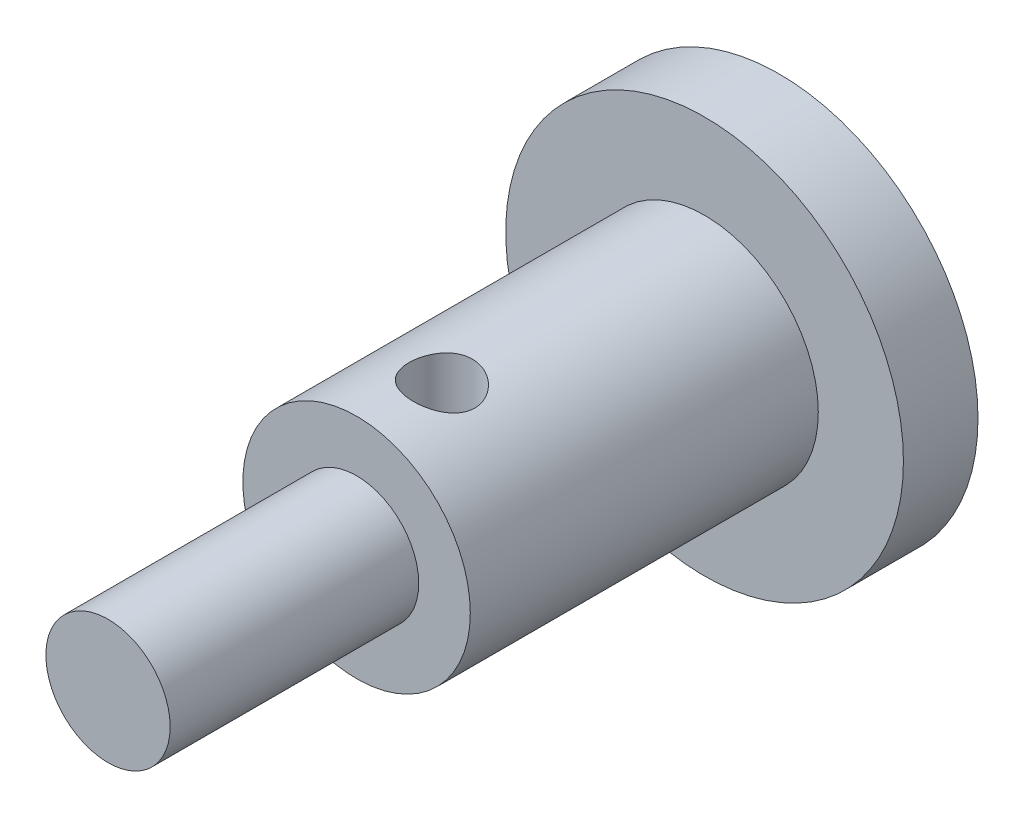
ISO-10303-21;
HEADER;
FILE_DESCRIPTION(('STEP AP214'),'2;1');
FILE_NAME('part.step','',(''),(''),'','','');
FILE_SCHEMA(('AUTOMOTIVE_DESIGN { 1 0 10303 214 1 1 1 1 }'));
ENDSEC;
DATA;
#1=APPLICATION_CONTEXT('core data for automotive mechanical design processes');
#2=APPLICATION_PROTOCOL_DEFINITION('international standard','automotive_design',2000,#1);
#3=PRODUCT_CONTEXT('',#1,'mechanical');
#4=PRODUCT('Part','Part','',(#3));
#5=PRODUCT_RELATED_PRODUCT_CATEGORY('part','',(#4));
#6=PRODUCT_DEFINITION_FORMATION('','',#4);
#7=PRODUCT_DEFINITION_CONTEXT('part definition',#1,'design');
#8=PRODUCT_DEFINITION('design','',#6,#7);
#9=PRODUCT_DEFINITION_SHAPE('','',#8);
#10=(LENGTH_UNIT() NAMED_UNIT(*) SI_UNIT(.MILLI.,.METRE.));
#11=(NAMED_UNIT(*) PLANE_ANGLE_UNIT() SI_UNIT($,.RADIAN.));
#12=(NAMED_UNIT(*) SI_UNIT($,.STERADIAN.) SOLID_ANGLE_UNIT());
#13=UNCERTAINTY_MEASURE_WITH_UNIT(LENGTH_MEASURE(1.E-05),#10,'distance_accuracy_value','');
#14=(GEOMETRIC_REPRESENTATION_CONTEXT(3) GLOBAL_UNCERTAINTY_ASSIGNED_CONTEXT((#13)) GLOBAL_UNIT_ASSIGNED_CONTEXT((#10,
#11,#12)) REPRESENTATION_CONTEXT('',''));
#15=CARTESIAN_POINT('',(0.,0.,0.));
#16=DIRECTION('',(0.,0.,1.));
#17=DIRECTION('',(1.,0.,0.));
#18=AXIS2_PLACEMENT_3D('',#15,#16,#17);
#19=CARTESIAN_POINT('',(0.,0.,17.));
#20=DIRECTION('',(0.,0.,1.));
#21=DIRECTION('',(1.,0.,0.));
#22=AXIS2_PLACEMENT_3D('',#19,#20,#21);
#23=PLANE('',#22);
#24=CARTESIAN_POINT('',(0.,0.,17.));
#25=DIRECTION('',(0.,0.,1.));
#26=DIRECTION('',(1.,0.,0.));
#27=AXIS2_PLACEMENT_3D('',#24,#25,#26);
#28=CIRCLE('',#27,4.575);
#29=CARTESIAN_POINT('',(4.575,0.,17.));
#30=VERTEX_POINT('',#29);
#31=EDGE_CURVE('E48',#30,#30,#28,.T.);
#32=ORIENTED_EDGE('',*,*,#31,.T.);
#33=EDGE_LOOP('',(#32));
#34=FACE_BOUND('',#33,.T.);
#35=CARTESIAN_POINT('',(0.,0.,17.));
#36=DIRECTION('',(0.,0.,1.));
#37=DIRECTION('',(1.,0.,0.));
#38=AXIS2_PLACEMENT_3D('',#35,#36,#37);
#39=CIRCLE('',#38,2.5);
#40=CARTESIAN_POINT('',(2.5,0.,17.));
#41=VERTEX_POINT('',#40);
#42=EDGE_CURVE('E85',#41,#41,#39,.T.);
#43=ORIENTED_EDGE('',*,*,#42,.F.);
#44=EDGE_LOOP('',(#43));
#45=FACE_BOUND('',#44,.T.);
#46=ADVANCED_FACE('F31',(#34,#45),#23,.T.);
#47=CARTESIAN_POINT('',(0.,0.,3.));
#48=DIRECTION('',(0.,0.,1.));
#49=DIRECTION('',(1.,0.,0.));
#50=AXIS2_PLACEMENT_3D('',#47,#48,#49);
#51=PLANE('',#50);
#52=CARTESIAN_POINT('',(0.,0.,3.));
#53=DIRECTION('',(0.,0.,1.));
#54=DIRECTION('',(1.,0.,0.));
#55=AXIS2_PLACEMENT_3D('',#52,#53,#54);
#56=CIRCLE('',#55,8.);
#57=CARTESIAN_POINT('',(8.,0.,3.));
#58=VERTEX_POINT('',#57);
#59=EDGE_CURVE('E10',#58,#58,#56,.T.);
#60=ORIENTED_EDGE('',*,*,#59,.T.);
#61=EDGE_LOOP('',(#60));
#62=FACE_BOUND('',#61,.T.);
#63=CARTESIAN_POINT('',(0.,0.,3.));
#64=DIRECTION('',(0.,0.,1.));
#65=DIRECTION('',(1.,0.,0.));
#66=AXIS2_PLACEMENT_3D('',#63,#64,#65);
#67=CIRCLE('',#66,4.575);
#68=CARTESIAN_POINT('',(4.575,0.,3.));
#69=VERTEX_POINT('',#68);
#70=EDGE_CURVE('E51',#69,#69,#67,.T.);
#71=ORIENTED_EDGE('',*,*,#70,.F.);
#72=EDGE_LOOP('',(#71));
#73=FACE_BOUND('',#72,.T.);
#74=ADVANCED_FACE('F75',(#62,#73),#51,.T.);
#75=CARTESIAN_POINT('',(0.,0.,3.));
#76=DIRECTION('',(0.,0.,-1.));
#77=DIRECTION('',(-1.,0.,0.));
#78=AXIS2_PLACEMENT_3D('',#75,#76,#77);
#79=CYLINDRICAL_SURFACE('',#78,8.);
#80=ORIENTED_EDGE('',*,*,#59,.F.);
#81=EDGE_LOOP('',(#80));
#82=FACE_BOUND('',#81,.T.);
#83=CARTESIAN_POINT('',(0.,0.,0.));
#84=DIRECTION('',(0.,0.,1.));
#85=DIRECTION('',(1.,0.,0.));
#86=AXIS2_PLACEMENT_3D('',#83,#84,#85);
#87=CIRCLE('',#86,8.);
#88=CARTESIAN_POINT('',(8.,0.,0.));
#89=VERTEX_POINT('',#88);
#90=EDGE_CURVE('E43',#89,#89,#87,.T.);
#91=ORIENTED_EDGE('',*,*,#90,.T.);
#92=EDGE_LOOP('',(#91));
#93=FACE_BOUND('',#92,.T.);
#94=ADVANCED_FACE('F33',(#82,#93),#79,.T.);
#95=CARTESIAN_POINT('',(0.,0.,0.));
#96=DIRECTION('',(0.,0.,1.));
#97=DIRECTION('',(1.,0.,0.));
#98=AXIS2_PLACEMENT_3D('',#95,#96,#97);
#99=PLANE('',#98);
#100=ORIENTED_EDGE('',*,*,#90,.F.);
#101=EDGE_LOOP('',(#100));
#102=FACE_BOUND('',#101,.T.);
#103=ADVANCED_FACE('F97',(#102),#99,.F.);
#104=CARTESIAN_POINT('',(0.,0.,17.));
#105=DIRECTION('',(0.,0.,-1.));
#106=DIRECTION('',(-1.,0.,0.));
#107=AXIS2_PLACEMENT_3D('',#104,#105,#106);
#108=CYLINDRICAL_SURFACE('',#107,4.575);
#109=CARTESIAN_POINT('',(0.425,-4.55521678957215,15.3185476202427));
#110=CARTESIAN_POINT('',(0.499175848809383,-4.54829478430847,15.3185457149563));
#111=CARTESIAN_POINT('',(0.573200619495583,-4.53954375008192,15.3122973102333));
#112=CARTESIAN_POINT('',(0.718755155952686,-4.51878668601295,15.2876842848335));
#113=CARTESIAN_POINT('',(0.790283304692836,-4.50677858920119,15.269311959532));
#114=CARTESIAN_POINT('',(0.928747214053876,-4.48029179469523,15.2212380895562));
#115=CARTESIAN_POINT('',(0.995692365395152,-4.46581837473261,15.1915605824641));
#116=CARTESIAN_POINT('',(1.12354332268067,-4.43538042652701,15.1218065184664));
#117=CARTESIAN_POINT('',(1.18444853448496,-4.41941575189089,15.0817289399207));
#118=CARTESIAN_POINT('',(1.30081956536695,-4.38660189958127,14.990649143292));
#119=CARTESIAN_POINT('',(1.35602394916938,-4.36974123766641,14.9393166427079));
#120=CARTESIAN_POINT('',(1.45709993020507,-4.33708562642922,14.8278473139774));
#121=CARTESIAN_POINT('',(1.50296995187501,-4.32129085732102,14.7677090024237));
#122=CARTESIAN_POINT('',(1.58441325810272,-4.29210366385075,14.6394625759518));
#123=CARTESIAN_POINT('',(1.61988856442241,-4.27873452464883,14.5712866199239));
#124=CARTESIAN_POINT('',(1.67866751755928,-4.25601958895294,14.4292547817062));
#125=CARTESIAN_POINT('',(1.70197765633808,-4.2466716470095,14.3554019531812));
#126=CARTESIAN_POINT('',(1.7344364667841,-4.23351460128523,14.2087395765653));
#127=CARTESIAN_POINT('',(1.74433480142186,-4.22941308149417,14.1361223980698));
#128=CARTESIAN_POINT('',(1.75200782538972,-4.22624113527994,13.9901515208578));
#129=CARTESIAN_POINT('',(1.74978669099213,-4.22716897577861,13.9167980845458));
#130=CARTESIAN_POINT('',(1.7337809587202,-4.23375635209484,13.7756170642194));
#131=CARTESIAN_POINT('',(1.72062514519805,-4.23915853843677,13.7077045548498));
#132=CARTESIAN_POINT('',(1.68408072828598,-4.25380784111861,13.5751337009528));
#133=CARTESIAN_POINT('',(1.66069072749376,-4.26305548251831,13.5104758021632));
#134=CARTESIAN_POINT('',(1.60376556459088,-4.28479953646227,13.384418105805));
#135=CARTESIAN_POINT('',(1.56999357451365,-4.29737071091755,13.3231385985682));
#136=CARTESIAN_POINT('',(1.4935105199176,-4.32454570376579,13.2069392685312));
#137=CARTESIAN_POINT('',(1.45079650439476,-4.33915019264906,13.1520215545364));
#138=CARTESIAN_POINT('',(1.35424250313405,-4.37028531359417,13.0461228647049));
#139=CARTESIAN_POINT('',(1.29983883370695,-4.38687932836816,12.9956735655194));
#140=CARTESIAN_POINT('',(1.18331908039615,-4.41973334464205,12.9044872657371));
#141=CARTESIAN_POINT('',(1.12120121446661,-4.43599326794914,12.8637525156553));
#142=CARTESIAN_POINT('',(0.988771879202566,-4.46740591998113,12.7920399786818));
#143=CARTESIAN_POINT('',(0.918271665438786,-4.48251133571938,12.7613884138409));
#144=CARTESIAN_POINT('',(0.772540680709144,-4.5099106747845,12.7126340857895));
#145=CARTESIAN_POINT('',(0.697311127133754,-4.52220531789137,12.6945281074997));
#146=CARTESIAN_POINT('',(0.546981939929057,-4.54279560886381,12.6720633514497));
#147=CARTESIAN_POINT('',(0.471966858009602,-4.55121427149677,12.6672531025428));
#148=CARTESIAN_POINT('',(0.321885008235394,-4.56428347776679,12.6704370369587));
#149=CARTESIAN_POINT('',(0.246818259228123,-4.56893501453431,12.6784278438734));
#150=CARTESIAN_POINT('',(0.102086487037848,-4.57441088688698,12.7064734943493));
#151=CARTESIAN_POINT('',(0.0323266344186926,-4.575386281446,12.7260130258752));
#152=CARTESIAN_POINT('',(-0.103057962894953,-4.5743403308932,12.7761770210942));
#153=CARTESIAN_POINT('',(-0.168682659730773,-4.57231895110453,12.8068016130536));
#154=CARTESIAN_POINT('',(-0.29405083599753,-4.56597288753354,12.8782878113212));
#155=CARTESIAN_POINT('',(-0.353788237249236,-4.56164585225617,12.9191598462323));
#156=CARTESIAN_POINT('',(-0.46576046061504,-4.55157750366431,13.0099977989872));
#157=CARTESIAN_POINT('',(-0.517994078036153,-4.54583596365934,13.0599651741272));
#158=CARTESIAN_POINT('',(-0.614950581868583,-4.5337531471103,13.1691669467753));
#159=CARTESIAN_POINT('',(-0.659428371358213,-4.52739974588602,13.2286178025588));
#160=CARTESIAN_POINT('',(-0.737872978910263,-4.51527955506445,13.3541496125545));
#161=CARTESIAN_POINT('',(-0.771839315173495,-4.50951279236423,13.4202308704916));
#162=CARTESIAN_POINT('',(-0.828542250641752,-4.49944269651708,13.5578398052549));
#163=CARTESIAN_POINT('',(-0.851178563853467,-4.49515253385899,13.6294098701846));
#164=CARTESIAN_POINT('',(-0.884064806702475,-4.48880152109347,13.7754339508661));
#165=CARTESIAN_POINT('',(-0.89431644660197,-4.48674036317562,13.8498875669477));
#166=CARTESIAN_POINT('',(-0.902035646439406,-4.48519472187284,13.9982032998313));
#167=CARTESIAN_POINT('',(-0.899718441325346,-4.48566685567203,14.0720538191997));
#168=CARTESIAN_POINT('',(-0.882873468997178,-4.48901230842492,14.2182902196503));
#169=CARTESIAN_POINT('',(-0.86834582100868,-4.49188560393311,14.2906761150264));
#170=CARTESIAN_POINT('',(-0.82764543656382,-4.49956109366248,14.4315576557255));
#171=CARTESIAN_POINT('',(-0.801535549169698,-4.50435286411061,14.5000720768693));
#172=CARTESIAN_POINT('',(-0.738441972710448,-4.51512435111741,14.6317971348532));
#173=CARTESIAN_POINT('',(-0.70145699352988,-4.52110420859189,14.6950071412848));
#174=CARTESIAN_POINT('',(-0.616881837610909,-4.53342411063939,14.815508037173));
#175=CARTESIAN_POINT('',(-0.569118845193433,-4.53976860354832,14.8726772468601));
#176=CARTESIAN_POINT('',(-0.464642508290202,-4.55164698825851,14.9782696945572));
#177=CARTESIAN_POINT('',(-0.407928111691564,-4.55718078462606,15.0266919030424));
#178=CARTESIAN_POINT('',(-0.286814225753326,-4.56640585184859,15.1136035642167));
#179=CARTESIAN_POINT('',(-0.222381934926759,-4.5700888860654,15.1520482526772));
#180=CARTESIAN_POINT('',(-0.0878975613435466,-4.57464876236592,15.2175354975881));
#181=CARTESIAN_POINT('',(-0.0178492146812162,-4.57552745442384,15.2445855606396));
#182=CARTESIAN_POINT('',(0.114215461734557,-4.57397215709719,15.2831155307311));
#183=CARTESIAN_POINT('',(0.175719101534481,-4.57204666488653,15.2963963741926));
#184=CARTESIAN_POINT('',(0.299850959361538,-4.56558613125911,15.3141130960154));
#185=CARTESIAN_POINT('',(0.362479145325154,-4.56105116413066,15.3185492261581));
#186=CARTESIAN_POINT('',(0.425,-4.55521678957215,15.3185476202427));
#187=B_SPLINE_CURVE_WITH_KNOTS('',3,(#109,#110,#111,#112,#113,#114,#115,#116,#117,#118,#119,
#120,#121,#122,#123,#124,#125,#126,#127,#128,#129,#130,#131,#132,#133,#134,#135,#136,#137,#138,
#139,#140,#141,#142,#143,#144,#145,#146,#147,#148,#149,#150,#151,#152,#153,#154,#155,#156,#157,
#158,#159,#160,#161,#162,#163,#164,#165,#166,#167,#168,#169,#170,#171,#172,#173,#174,#175,#176,
#177,#178,#179,#180,#181,#182,#183,#184,#185,#186),.UNSPECIFIED.,.T.,.F.,(4,2,2,2,2,2,2,2,2,2,2,
2,2,2,2,2,2,2,2,2,2,2,2,2,2,2,2,2,2,2,2,2,2,2,2,2,2,2,4),(0.,0.223257079772313,
0.446656173889252,0.669582894478064,0.892531522333499,1.12320153819226,1.35391045701032,
1.58672876179929,1.81942269534358,2.03848387756036,2.25746957780995,2.46466937440326,
2.67189747142387,2.88425591792349,3.0966845567214,3.32374453285558,3.55085705971327,
3.78472431213343,4.01853160879814,4.24429605903479,4.47000097141454,4.68632330578078,
4.90264814331719,5.11919402999378,5.33577464321324,5.55829140211992,5.78081835871458,
6.00528160797694,6.22971385642882,6.45031508473508,6.67091415906458,6.89033056037492,
7.10977300162835,7.33302156426881,7.55629638623558,7.78055626084569,8.0046681646275,
8.1928509900012,8.38102845832306),.UNSPECIFIED.);
#188=CARTESIAN_POINT('',(0.425,-4.55521678957215,15.3185476202427));
#189=VERTEX_POINT('',#188);
#190=EDGE_CURVE('E35',#189,#189,#187,.T.);
#191=ORIENTED_EDGE('',*,*,#190,.T.);
#192=EDGE_LOOP('',(#191));
#193=FACE_BOUND('',#192,.T.);
#194=CARTESIAN_POINT('',(0.425,4.55521678957215,15.3185476202427));
#195=CARTESIAN_POINT('',(0.353144728522285,4.5619207246644,15.3185472744102));
#196=CARTESIAN_POINT('',(0.281124469497373,4.56690961752312,15.3126846128781));
#197=CARTESIAN_POINT('',(0.138839887967242,4.57344759319053,15.2892852605926));
#198=CARTESIAN_POINT('',(0.0685757195016719,4.57499637528153,15.2717475494375));
#199=CARTESIAN_POINT('',(-0.0681114326100074,4.57500361274798,15.2254849528648));
#200=CARTESIAN_POINT('',(-0.134536765880178,4.57346397949879,15.1967669956036));
#201=CARTESIAN_POINT('',(-0.261758031746744,4.56795004877663,15.1289708592763));
#202=CARTESIAN_POINT('',(-0.322553263416168,4.56397544862705,15.0898913925735));
#203=CARTESIAN_POINT('',(-0.437637195637903,4.55439124243084,15.0019098876971));
#204=CARTESIAN_POINT('',(-0.491834380387706,4.54876168891618,14.9528904195081));
#205=CARTESIAN_POINT('',(-0.591425842160971,4.53688893681922,14.8466630721619));
#206=CARTESIAN_POINT('',(-0.636818973030744,4.5306456584985,14.7894541285426));
#207=CARTESIAN_POINT('',(-0.71861010581597,4.51840474865358,14.6668537083133));
#208=CARTESIAN_POINT('',(-0.754762208039619,4.51241679813758,14.6012969297966));
#209=CARTESIAN_POINT('',(-0.815557712875213,4.50182722741717,14.4649421752977));
#210=CARTESIAN_POINT('',(-0.840201733334883,4.49722553279193,14.3941444809271));
#211=CARTESIAN_POINT('',(-0.877141295144193,4.49016746486438,14.2496469657658));
#212=CARTESIAN_POINT('',(-0.889494733974172,4.48770104011384,14.1759624679335));
#213=CARTESIAN_POINT('',(-0.901655181649622,4.48527405189913,14.0275285291307));
#214=CARTESIAN_POINT('',(-0.901463629449167,4.48531320103691,13.9527792112821));
#215=CARTESIAN_POINT('',(-0.888655639345165,4.48786756787795,13.8056857394728));
#216=CARTESIAN_POINT('',(-0.876250604577347,4.49034065624654,13.733322301654));
#217=CARTESIAN_POINT('',(-0.839716681934786,4.49731511608313,13.5917216684031));
#218=CARTESIAN_POINT('',(-0.815587027769383,4.5018166201217,13.5224846776307));
#219=CARTESIAN_POINT('',(-0.756126078579706,4.51218459380942,13.3885966941245));
#220=CARTESIAN_POINT('',(-0.72072595241577,4.51805939025167,13.3239769501796));
#221=CARTESIAN_POINT('',(-0.639745867189719,4.53023417421993,13.2015046836981));
#222=CARTESIAN_POINT('',(-0.59416461551805,4.53653421566469,13.1436530218687));
#223=CARTESIAN_POINT('',(-0.493165078381304,4.54863032170997,13.0353340403439));
#224=CARTESIAN_POINT('',(-0.43759261706071,4.55441598765468,12.985009108193));
#225=CARTESIAN_POINT('',(-0.318665725345422,4.5642776316443,12.8943778655584));
#226=CARTESIAN_POINT('',(-0.255311892823662,4.56835374093498,12.8540707860827));
#227=CARTESIAN_POINT('',(-0.123237381953327,4.57381235560764,12.7850109978485));
#228=CARTESIAN_POINT('',(-0.0545728246059681,4.57521985050939,12.7561531165657));
#229=CARTESIAN_POINT('',(0.0866023415020523,4.5747240900215,12.7103421378452));
#230=CARTESIAN_POINT('',(0.159112120664876,4.5728215459705,12.6933864836774));
#231=CARTESIAN_POINT('',(0.303755961835413,4.56546369083202,12.6721380695963));
#232=CARTESIAN_POINT('',(0.375846461708653,4.56010656181995,12.6675129763749));
#233=CARTESIAN_POINT('',(0.519484555547873,4.54598383799178,12.6699700096512));
#234=CARTESIAN_POINT('',(0.59103214884803,4.53721823899622,12.6770521505044));
#235=CARTESIAN_POINT('',(0.731701476930526,4.51666909019126,12.7025494793423));
#236=CARTESIAN_POINT('',(0.800820348292434,4.50488210556831,12.7209775994701));
#237=CARTESIAN_POINT('',(0.934827356427687,4.47899384236046,12.7684931407137));
#238=CARTESIAN_POINT('',(0.99971458874402,4.46489207127102,12.7975828318613));
#239=CARTESIAN_POINT('',(1.12636437958887,4.43467507639761,12.8669855200413));
#240=CARTESIAN_POINT('',(1.18788420531828,4.41850045213729,12.9077155349276));
#241=CARTESIAN_POINT('',(1.30330246550969,4.3858444397395,12.9987532822495));
#242=CARTESIAN_POINT('',(1.35719843274294,4.36936295423955,13.0490641029178));
#243=CARTESIAN_POINT('',(1.45784345197293,4.33684419561184,13.1600780140099));
#244=CARTESIAN_POINT('',(1.50426451115007,4.3208444005896,13.2210905475313));
#245=CARTESIAN_POINT('',(1.58611989944755,4.2914737653962,13.3506680919607));
#246=CARTESIAN_POINT('',(1.62155630371703,4.27810242884869,13.419231673053));
#247=CARTESIAN_POINT('',(1.67933434409801,4.25574906569975,13.5600740150932));
#248=CARTESIAN_POINT('',(1.70201394048593,4.24665492009619,13.6321956160533));
#249=CARTESIAN_POINT('',(1.73479986166472,4.23336930624281,13.7796654442697));
#250=CARTESIAN_POINT('',(1.74491362530721,4.22917493746044,13.8550117351836));
#251=CARTESIAN_POINT('',(1.75185492606084,4.22630318839623,14.001150753327));
#252=CARTESIAN_POINT('',(1.74955667861706,4.22726277235816,14.0718961738315));
#253=CARTESIAN_POINT('',(1.7337804414532,4.23375741099004,14.2119070243754));
#254=CARTESIAN_POINT('',(1.72030293995195,4.23929226584935,14.2811725189102));
#255=CARTESIAN_POINT('',(1.68303486821785,4.25422244206679,14.4151246257323));
#256=CARTESIAN_POINT('',(1.65942345080378,4.26355056010795,14.4798690480019));
#257=CARTESIAN_POINT('',(1.60272175293737,4.28518669579854,14.604520828168));
#258=CARTESIAN_POINT('',(1.56962921023601,4.29749542452959,14.6644270272593));
#259=CARTESIAN_POINT('',(1.49274698808033,4.32482193426436,14.7814028272834));
#260=CARTESIAN_POINT('',(1.44845404709587,4.33995433663009,14.8381146493963));
#261=CARTESIAN_POINT('',(1.35144166189072,4.37113537803558,14.9435297619615));
#262=CARTESIAN_POINT('',(1.29871886249384,4.38718438025038,14.9922298479305));
#263=CARTESIAN_POINT('',(1.18277038245558,4.41989924671875,15.0831086482567));
#264=CARTESIAN_POINT('',(1.11911259205227,4.43654681424556,15.1247444568246));
#265=CARTESIAN_POINT('',(0.985297744286188,4.46816862994837,15.1966504024522));
#266=CARTESIAN_POINT('',(0.915142509317365,4.48314334473965,15.2269237144848));
#267=CARTESIAN_POINT('',(0.775843276291697,4.50924787280731,15.2731932580457));
#268=CARTESIAN_POINT('',(0.707046512883003,4.5205863737492,15.29011823238));
#269=CARTESIAN_POINT('',(0.567220024645227,4.54024939315986,15.3127938800065));
#270=CARTESIAN_POINT('',(0.496190987878909,4.54857483064445,15.318547962878));
#271=CARTESIAN_POINT('',(0.425,4.55521678957215,15.3185476202427));
#272=B_SPLINE_CURVE_WITH_KNOTS('',3,(#194,#195,#196,#197,#198,#199,#200,#201,#202,#203,#204,
#205,#206,#207,#208,#209,#210,#211,#212,#213,#214,#215,#216,#217,#218,#219,#220,#221,#222,#223,
#224,#225,#226,#227,#228,#229,#230,#231,#232,#233,#234,#235,#236,#237,#238,#239,#240,#241,#242,
#243,#244,#245,#246,#247,#248,#249,#250,#251,#252,#253,#254,#255,#256,#257,#258,#259,#260,#261,
#262,#263,#264,#265,#266,#267,#268,#269,#270,#271),.UNSPECIFIED.,.T.,.F.,(4,2,2,2,2,2,2,2,2,2,2,
2,2,2,2,2,2,2,2,2,2,2,2,2,2,2,2,2,2,2,2,2,2,2,2,2,2,2,4),(0.,0.216248949026221,
0.432516800735727,0.64865084871131,0.864811768510005,1.08369313331129,1.30260297403326,
1.52684236473612,1.75106971505435,1.97423571983931,2.19737612675268,2.41672090805353,
2.63608002708806,2.85680538033674,3.07755877312172,3.30206815071471,3.52656028915956,
3.7489396444306,3.97127121552391,4.18754690146848,4.40382285261143,4.62034577253187,
4.8369148207129,5.06250470080439,5.28816741995738,5.52197148071598,5.75573134578532,
5.98296509885703,6.21006426754774,6.42138626196534,6.63269902804389,6.84042073948756,
7.04819205581914,7.26783763698349,7.48757085811855,7.72006375223964,7.95249163343557,
8.16680683983777,8.38105662266307),.UNSPECIFIED.);
#273=CARTESIAN_POINT('',(0.425,4.55521678957215,15.3185476202427));
#274=VERTEX_POINT('',#273);
#275=EDGE_CURVE('E53',#274,#274,#272,.T.);
#276=ORIENTED_EDGE('',*,*,#275,.T.);
#277=EDGE_LOOP('',(#276));
#278=FACE_BOUND('',#277,.T.);
#279=ORIENTED_EDGE('',*,*,#31,.F.);
#280=EDGE_LOOP('',(#279));
#281=FACE_BOUND('',#280,.T.);
#282=ORIENTED_EDGE('',*,*,#70,.T.);
#283=EDGE_LOOP('',(#282));
#284=FACE_BOUND('',#283,.T.);
#285=ADVANCED_FACE('F57',(#193,#278,#281,#284),#108,.T.);
#286=CARTESIAN_POINT('',(0.,0.,27.));
#287=DIRECTION('',(0.,0.,-1.));
#288=DIRECTION('',(-1.,0.,0.));
#289=AXIS2_PLACEMENT_3D('',#286,#287,#288);
#290=CYLINDRICAL_SURFACE('',#289,2.5);
#291=CARTESIAN_POINT('',(0.,0.,27.));
#292=DIRECTION('',(0.,0.,1.));
#293=DIRECTION('',(1.,0.,0.));
#294=AXIS2_PLACEMENT_3D('',#291,#292,#293);
#295=CIRCLE('',#294,2.5);
#296=CARTESIAN_POINT('',(2.5,0.,27.));
#297=VERTEX_POINT('',#296);
#298=EDGE_CURVE('E87',#297,#297,#295,.T.);
#299=ORIENTED_EDGE('',*,*,#298,.F.);
#300=EDGE_LOOP('',(#299));
#301=FACE_BOUND('',#300,.T.);
#302=ORIENTED_EDGE('',*,*,#42,.T.);
#303=EDGE_LOOP('',(#302));
#304=FACE_BOUND('',#303,.T.);
#305=ADVANCED_FACE('F70',(#301,#304),#290,.T.);
#306=CARTESIAN_POINT('',(0.,0.,27.));
#307=DIRECTION('',(0.,0.,1.));
#308=DIRECTION('',(1.,0.,0.));
#309=AXIS2_PLACEMENT_3D('',#306,#307,#308);
#310=PLANE('',#309);
#311=ORIENTED_EDGE('',*,*,#298,.T.);
#312=EDGE_LOOP('',(#311));
#313=FACE_BOUND('',#312,.T.);
#314=ADVANCED_FACE('F65',(#313),#310,.T.);
#315=CARTESIAN_POINT('',(0.425,-7.5,13.9935476202427));
#316=DIRECTION('',(0.,1.,0.));
#317=DIRECTION('',(0.,0.,1.));
#318=AXIS2_PLACEMENT_3D('',#315,#316,#317);
#319=CYLINDRICAL_SURFACE('',#318,1.325);
#320=ORIENTED_EDGE('',*,*,#275,.F.);
#321=EDGE_LOOP('',(#320));
#322=FACE_BOUND('',#321,.T.);
#323=ORIENTED_EDGE('',*,*,#190,.F.);
#324=EDGE_LOOP('',(#323));
#325=FACE_BOUND('',#324,.T.);
#326=ADVANCED_FACE('F61',(#322,#325),#319,.F.);
#327=CLOSED_SHELL('',(#46,#74,#94,#103,#285,#305,#314,#326));
#328=MANIFOLD_SOLID_BREP('B2',#327);
#329=ADVANCED_BREP_SHAPE_REPRESENTATION('',(#18,#328),#14);
#330=SHAPE_DEFINITION_REPRESENTATION(#9,#329);
ENDSEC;
END-ISO-10303-21;
